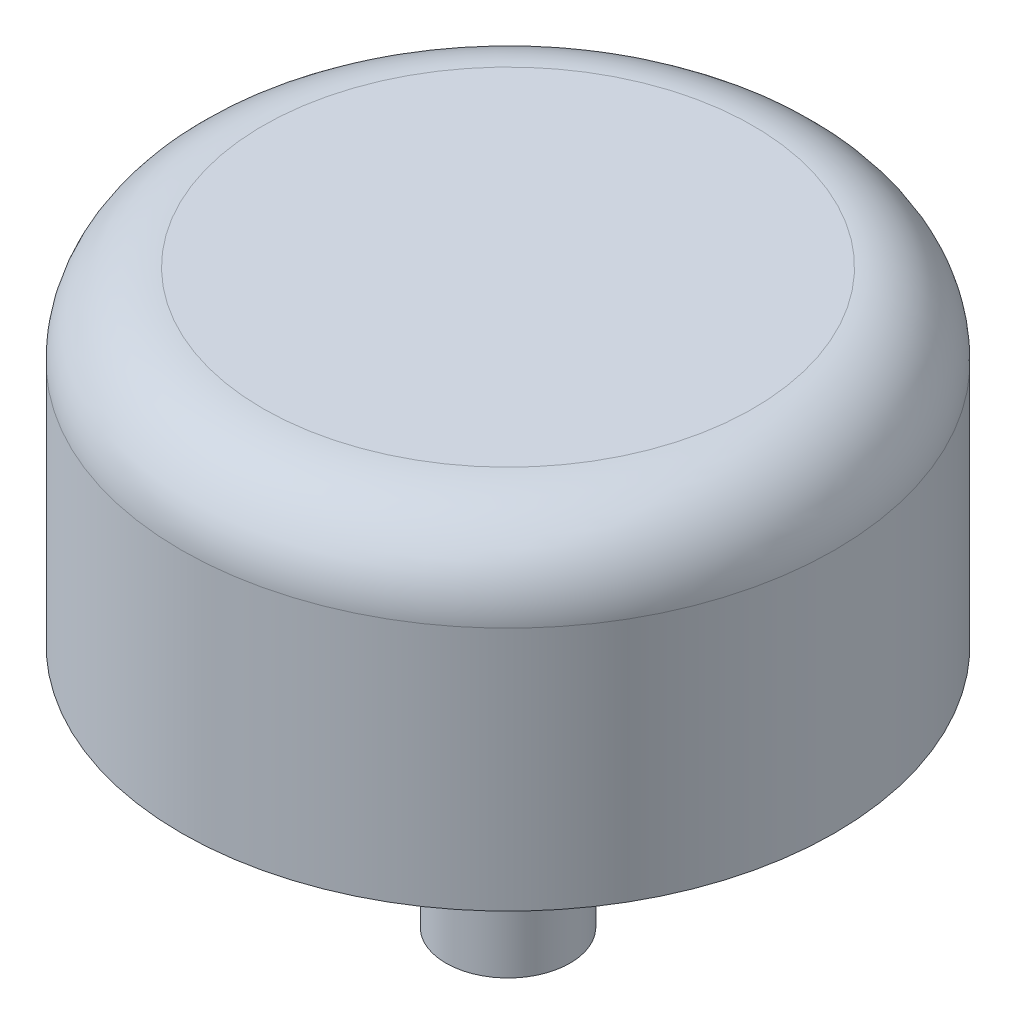
ISO-10303-21;
HEADER;
FILE_DESCRIPTION(('STEP AP214'),'2;1');
FILE_NAME('part.step','',(''),(''),'','','');
FILE_SCHEMA(('AUTOMOTIVE_DESIGN { 1 0 10303 214 1 1 1 1 }'));
ENDSEC;
DATA;
#1=APPLICATION_CONTEXT('core data for automotive mechanical design processes');
#2=APPLICATION_PROTOCOL_DEFINITION('international standard','automotive_design',2000,#1);
#3=PRODUCT_CONTEXT('',#1,'mechanical');
#4=PRODUCT('Part','Part','',(#3));
#5=PRODUCT_RELATED_PRODUCT_CATEGORY('part','',(#4));
#6=PRODUCT_DEFINITION_FORMATION('','',#4);
#7=PRODUCT_DEFINITION_CONTEXT('part definition',#1,'design');
#8=PRODUCT_DEFINITION('design','',#6,#7);
#9=PRODUCT_DEFINITION_SHAPE('','',#8);
#10=(LENGTH_UNIT() NAMED_UNIT(*) SI_UNIT(.MILLI.,.METRE.));
#11=(NAMED_UNIT(*) PLANE_ANGLE_UNIT() SI_UNIT($,.RADIAN.));
#12=(NAMED_UNIT(*) SI_UNIT($,.STERADIAN.) SOLID_ANGLE_UNIT());
#13=UNCERTAINTY_MEASURE_WITH_UNIT(LENGTH_MEASURE(1.E-05),#10,'distance_accuracy_value','');
#14=(GEOMETRIC_REPRESENTATION_CONTEXT(3) GLOBAL_UNCERTAINTY_ASSIGNED_CONTEXT((#13)) GLOBAL_UNIT_ASSIGNED_CONTEXT((#10,
#11,#12)) REPRESENTATION_CONTEXT('',''));
#15=CARTESIAN_POINT('',(0.,0.,0.));
#16=DIRECTION('',(0.,0.,1.));
#17=DIRECTION('',(1.,0.,0.));
#18=AXIS2_PLACEMENT_3D('',#15,#16,#17);
#19=CARTESIAN_POINT('',(0.,-9.525,0.));
#20=DIRECTION('',(0.,-1.,0.));
#21=DIRECTION('',(0.,0.,-1.));
#22=AXIS2_PLACEMENT_3D('',#19,#20,#21);
#23=PLANE('',#22);
#24=CARTESIAN_POINT('',(0.,-9.52500000000001,0.));
#25=DIRECTION('',(0.,1.,0.));
#26=DIRECTION('',(0.,0.,1.));
#27=AXIS2_PLACEMENT_3D('',#24,#25,#26);
#28=CIRCLE('',#27,2.41299999999999);
#29=CARTESIAN_POINT('',(0.,-9.52500000000001,2.41299999999999));
#30=VERTEX_POINT('',#29);
#31=EDGE_CURVE('E10',#30,#30,#28,.T.);
#32=ORIENTED_EDGE('',*,*,#31,.F.);
#33=EDGE_LOOP('',(#32));
#34=FACE_BOUND('',#33,.T.);
#35=ADVANCED_FACE('F36',(#34),#23,.T.);
#36=CARTESIAN_POINT('',(0.,52.5,0.));
#37=DIRECTION('',(0.,1.,0.));
#38=DIRECTION('',(0.,0.,1.));
#39=AXIS2_PLACEMENT_3D('',#36,#37,#38);
#40=CYLINDRICAL_SURFACE('',#39,2.41299999999999);
#41=ORIENTED_EDGE('',*,*,#31,.T.);
#42=EDGE_LOOP('',(#41));
#43=FACE_BOUND('',#42,.T.);
#44=CARTESIAN_POINT('',(0.,0.,0.));
#45=DIRECTION('',(0.,1.,0.));
#46=DIRECTION('',(0.,0.,1.));
#47=AXIS2_PLACEMENT_3D('',#44,#45,#46);
#48=CIRCLE('',#47,2.41299999999999);
#49=CARTESIAN_POINT('',(0.,0.,2.41299999999999));
#50=VERTEX_POINT('',#49);
#51=EDGE_CURVE('E42',#50,#50,#48,.T.);
#52=ORIENTED_EDGE('',*,*,#51,.F.);
#53=EDGE_LOOP('',(#52));
#54=FACE_BOUND('',#53,.T.);
#55=ADVANCED_FACE('F77',(#43,#54),#40,.T.);
#56=CARTESIAN_POINT('',(-2.41299999999999,0.,0.));
#57=DIRECTION('',(0.,-1.,0.));
#58=DIRECTION('',(0.,0.,-1.));
#59=AXIS2_PLACEMENT_3D('',#56,#57,#58);
#60=PLANE('',#59);
#61=ORIENTED_EDGE('',*,*,#51,.T.);
#62=EDGE_LOOP('',(#61));
#63=FACE_BOUND('',#62,.T.);
#64=CARTESIAN_POINT('',(0.,0.,0.));
#65=DIRECTION('',(0.,1.,0.));
#66=DIRECTION('',(0.,0.,1.));
#67=AXIS2_PLACEMENT_3D('',#64,#65,#66);
#68=CIRCLE('',#67,12.7);
#69=CARTESIAN_POINT('',(0.,0.,12.7));
#70=VERTEX_POINT('',#69);
#71=EDGE_CURVE('E46',#70,#70,#68,.T.);
#72=ORIENTED_EDGE('',*,*,#71,.F.);
#73=EDGE_LOOP('',(#72));
#74=FACE_BOUND('',#73,.T.);
#75=ADVANCED_FACE('F73',(#63,#74),#60,.T.);
#76=CARTESIAN_POINT('',(0.,52.5,0.));
#77=DIRECTION('',(0.,1.,0.));
#78=DIRECTION('',(0.,0.,1.));
#79=AXIS2_PLACEMENT_3D('',#76,#77,#78);
#80=CYLINDRICAL_SURFACE('',#79,12.7);
#81=ORIENTED_EDGE('',*,*,#71,.T.);
#82=EDGE_LOOP('',(#81));
#83=FACE_BOUND('',#82,.T.);
#84=CARTESIAN_POINT('',(0.,9.52499999999998,0.));
#85=DIRECTION('',(0.,1.,0.));
#86=DIRECTION('',(0.,0.,1.));
#87=AXIS2_PLACEMENT_3D('',#84,#85,#86);
#88=CIRCLE('',#87,12.7);
#89=CARTESIAN_POINT('',(0.,9.52499999999998,12.7));
#90=VERTEX_POINT('',#89);
#91=EDGE_CURVE('E51',#90,#90,#88,.T.);
#92=ORIENTED_EDGE('',*,*,#91,.F.);
#93=EDGE_LOOP('',(#92));
#94=FACE_BOUND('',#93,.T.);
#95=ADVANCED_FACE('F65',(#83,#94),#80,.T.);
#96=CARTESIAN_POINT('',(0.,9.525,0.));
#97=DIRECTION('',(0.,1.,0.));
#98=DIRECTION('',(0.,0.,1.));
#99=AXIS2_PLACEMENT_3D('',#96,#97,#98);
#100=TOROIDAL_SURFACE('',#99,9.525,3.175);
#101=ORIENTED_EDGE('',*,*,#91,.T.);
#102=EDGE_LOOP('',(#101));
#103=FACE_BOUND('',#102,.T.);
#104=CARTESIAN_POINT('',(0.,12.7,0.));
#105=DIRECTION('',(0.,1.,0.));
#106=DIRECTION('',(0.,0.,1.));
#107=AXIS2_PLACEMENT_3D('',#104,#105,#106);
#108=CIRCLE('',#107,9.52499999999998);
#109=CARTESIAN_POINT('',(0.,12.7,9.52499999999998));
#110=VERTEX_POINT('',#109);
#111=EDGE_CURVE('E57',#110,#110,#108,.T.);
#112=ORIENTED_EDGE('',*,*,#111,.F.);
#113=EDGE_LOOP('',(#112));
#114=FACE_BOUND('',#113,.T.);
#115=ADVANCED_FACE('F63',(#103,#114),#100,.T.);
#116=CARTESIAN_POINT('',(-9.52499999999998,12.7,0.));
#117=DIRECTION('',(0.,1.,0.));
#118=DIRECTION('',(0.,0.,1.));
#119=AXIS2_PLACEMENT_3D('',#116,#117,#118);
#120=PLANE('',#119);
#121=ORIENTED_EDGE('',*,*,#111,.T.);
#122=EDGE_LOOP('',(#121));
#123=FACE_BOUND('',#122,.T.);
#124=ADVANCED_FACE('F61',(#123),#120,.T.);
#125=CLOSED_SHELL('',(#35,#55,#75,#95,#115,#124));
#126=MANIFOLD_SOLID_BREP('B2',#125);
#127=ADVANCED_BREP_SHAPE_REPRESENTATION('',(#18,#126),#14);
#128=SHAPE_DEFINITION_REPRESENTATION(#9,#127);
ENDSEC;
END-ISO-10303-21;
